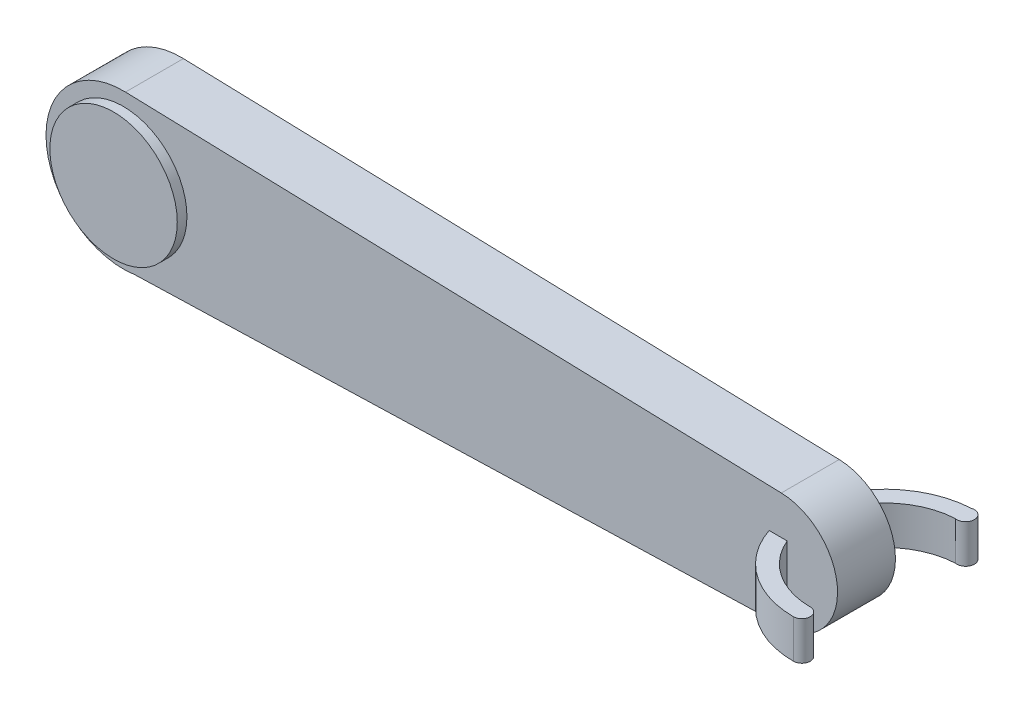
ISO-10303-21;
HEADER;
FILE_DESCRIPTION(('STEP AP214'),'2;1');
FILE_NAME('part.step','',(''),(''),'','','');
FILE_SCHEMA(('AUTOMOTIVE_DESIGN { 1 0 10303 214 1 1 1 1 }'));
ENDSEC;
DATA;
#1=APPLICATION_CONTEXT('core data for automotive mechanical design processes');
#2=APPLICATION_PROTOCOL_DEFINITION('international standard','automotive_design',2000,#1);
#3=PRODUCT_CONTEXT('',#1,'mechanical');
#4=PRODUCT('Part','Part','',(#3));
#5=PRODUCT_RELATED_PRODUCT_CATEGORY('part','',(#4));
#6=PRODUCT_DEFINITION_FORMATION('','',#4);
#7=PRODUCT_DEFINITION_CONTEXT('part definition',#1,'design');
#8=PRODUCT_DEFINITION('design','',#6,#7);
#9=PRODUCT_DEFINITION_SHAPE('','',#8);
#10=(LENGTH_UNIT() NAMED_UNIT(*) SI_UNIT(.MILLI.,.METRE.));
#11=(NAMED_UNIT(*) PLANE_ANGLE_UNIT() SI_UNIT($,.RADIAN.));
#12=(NAMED_UNIT(*) SI_UNIT($,.STERADIAN.) SOLID_ANGLE_UNIT());
#13=UNCERTAINTY_MEASURE_WITH_UNIT(LENGTH_MEASURE(1.E-05),#10,'distance_accuracy_value','');
#14=(GEOMETRIC_REPRESENTATION_CONTEXT(3) GLOBAL_UNCERTAINTY_ASSIGNED_CONTEXT((#13)) GLOBAL_UNIT_ASSIGNED_CONTEXT((#10,
#11,#12)) REPRESENTATION_CONTEXT('',''));
#15=CARTESIAN_POINT('',(0.,0.,0.));
#16=DIRECTION('',(0.,0.,1.));
#17=DIRECTION('',(1.,0.,0.));
#18=AXIS2_PLACEMENT_3D('',#15,#16,#17);
#19=CARTESIAN_POINT('',(0.,0.,7.5));
#20=DIRECTION('',(0.,0.,1.));
#21=DIRECTION('',(1.,0.,0.));
#22=AXIS2_PLACEMENT_3D('',#19,#20,#21);
#23=PLANE('',#22);
#24=CARTESIAN_POINT('',(-85.,0.,7.5));
#25=DIRECTION('',(0.,0.,1.));
#26=DIRECTION('',(1.,0.,0.));
#27=AXIS2_PLACEMENT_3D('',#24,#25,#26);
#28=CIRCLE('',#27,16.5);
#29=CARTESIAN_POINT('',(-68.5,0.,7.5));
#30=VERTEX_POINT('',#29);
#31=EDGE_CURVE('E222',#30,#30,#28,.F.);
#32=ORIENTED_EDGE('',*,*,#31,.T.);
#33=EDGE_LOOP('',(#32));
#34=FACE_BOUND('',#33,.T.);
#35=DIRECTION('',(0.999543215437971,0.0302218542105337,0.));
#36=VECTOR('',#35,1.);
#37=CARTESIAN_POINT('',(0.522370495305952,-17.2766330249204,7.5));
#38=LINE('',#37,#36);
#39=CARTESIAN_POINT('',(-81.9838543922029,-19.7712636336822,7.5));
#40=VERTEX_POINT('',#39);
#41=CARTESIAN_POINT('',(88.350129521236,-14.6211022905574,7.5));
#42=VERTEX_POINT('',#41);
#43=EDGE_CURVE('E223',#40,#42,#38,.T.);
#44=ORIENTED_EDGE('',*,*,#43,.T.);
#45=CARTESIAN_POINT('',(85.,0.,7.5));
#46=DIRECTION('',(0.,0.,1.));
#47=DIRECTION('',(1.,0.,0.));
#48=AXIS2_PLACEMENT_3D('',#45,#46,#47);
#49=CIRCLE('',#48,15.);
#50=CARTESIAN_POINT('',(85.4411764705882,14.9935107070292,7.5));
#51=VERTEX_POINT('',#50);
#52=EDGE_CURVE('E226',#42,#51,#49,.T.);
#53=ORIENTED_EDGE('',*,*,#52,.T.);
#54=DIRECTION('',(0.999567380468613,-0.0294117647058824,0.));
#55=VECTOR('',#54,1.);
#56=CARTESIAN_POINT('',(0.514705882352942,17.4924291582007,7.5));
#57=LINE('',#56,#55);
#58=CARTESIAN_POINT('',(-84.4117647058823,19.9913476093723,7.5));
#59=VERTEX_POINT('',#58);
#60=EDGE_CURVE('E229',#59,#51,#57,.T.);
#61=ORIENTED_EDGE('',*,*,#60,.F.);
#62=CARTESIAN_POINT('',(-85.,0.,7.5));
#63=DIRECTION('',(0.,0.,1.));
#64=DIRECTION('',(1.,0.,0.));
#65=AXIS2_PLACEMENT_3D('',#62,#63,#64);
#66=CIRCLE('',#65,20.);
#67=EDGE_CURVE('E232',#59,#40,#66,.T.);
#68=ORIENTED_EDGE('',*,*,#67,.T.);
#69=EDGE_LOOP('',(#44,#53,#61,#68));
#70=FACE_BOUND('',#69,.T.);
#71=DIRECTION('',(0.,-1.,0.));
#72=VECTOR('',#71,1.);
#73=CARTESIAN_POINT('',(86.9563657070354,5.,7.5));
#74=LINE('',#73,#72);
#75=CARTESIAN_POINT('',(86.9563657070354,5.,7.5));
#76=VERTEX_POINT('',#75);
#77=CARTESIAN_POINT('',(86.9563657070354,-5.,7.5));
#78=VERTEX_POINT('',#77);
#79=EDGE_CURVE('E93',#76,#78,#74,.T.);
#80=ORIENTED_EDGE('',*,*,#79,.T.);
#81=DIRECTION('',(-1.,0.,0.));
#82=VECTOR('',#81,1.);
#83=CARTESIAN_POINT('',(0.,-5.,7.5));
#84=LINE('',#83,#82);
#85=CARTESIAN_POINT('',(82.2870952426982,-5.,7.5));
#86=VERTEX_POINT('',#85);
#87=EDGE_CURVE('E88',#78,#86,#84,.T.);
#88=ORIENTED_EDGE('',*,*,#87,.T.);
#89=DIRECTION('',(0.,-1.,0.));
#90=VECTOR('',#89,1.);
#91=CARTESIAN_POINT('',(82.2870952426982,5.,7.5));
#92=LINE('',#91,#90);
#93=CARTESIAN_POINT('',(82.2870952426982,5.,7.5));
#94=VERTEX_POINT('',#93);
#95=EDGE_CURVE('E214',#86,#94,#92,.F.);
#96=ORIENTED_EDGE('',*,*,#95,.T.);
#97=DIRECTION('',(-1.,0.,0.));
#98=VECTOR('',#97,1.);
#99=CARTESIAN_POINT('',(0.,5.,7.5));
#100=LINE('',#99,#98);
#101=EDGE_CURVE('E170',#76,#94,#100,.T.);
#102=ORIENTED_EDGE('',*,*,#101,.F.);
#103=EDGE_LOOP('',(#80,#88,#96,#102));
#104=FACE_BOUND('',#103,.T.);
#105=ADVANCED_FACE('F73',(#34,#70,#104),#23,.T.);
#106=CARTESIAN_POINT('',(0.,0.,-7.5));
#107=DIRECTION('',(0.,0.,1.));
#108=DIRECTION('',(1.,0.,0.));
#109=AXIS2_PLACEMENT_3D('',#106,#107,#108);
#110=PLANE('',#109);
#111=DIRECTION('',(0.999543215437971,0.0302218542105337,0.));
#112=VECTOR('',#111,1.);
#113=CARTESIAN_POINT('',(0.522370495305952,-17.2766330249204,-7.5));
#114=LINE('',#113,#112);
#115=CARTESIAN_POINT('',(-81.9838543922029,-19.7712636336822,-7.5));
#116=VERTEX_POINT('',#115);
#117=CARTESIAN_POINT('',(88.350129521236,-14.6211022905574,-7.5));
#118=VERTEX_POINT('',#117);
#119=EDGE_CURVE('E235',#116,#118,#114,.T.);
#120=ORIENTED_EDGE('',*,*,#119,.F.);
#121=CARTESIAN_POINT('',(-85.,0.,-7.5));
#122=DIRECTION('',(0.,0.,1.));
#123=DIRECTION('',(1.,0.,0.));
#124=AXIS2_PLACEMENT_3D('',#121,#122,#123);
#125=CIRCLE('',#124,20.);
#126=CARTESIAN_POINT('',(-84.4117647058823,19.9913476093723,-7.5));
#127=VERTEX_POINT('',#126);
#128=EDGE_CURVE('E227',#127,#116,#125,.T.);
#129=ORIENTED_EDGE('',*,*,#128,.F.);
#130=DIRECTION('',(0.999567380468613,-0.0294117647058824,0.));
#131=VECTOR('',#130,1.);
#132=CARTESIAN_POINT('',(0.514705882352942,17.4924291582007,-7.5));
#133=LINE('',#132,#131);
#134=CARTESIAN_POINT('',(85.4411764705882,14.9935107070292,-7.5));
#135=VERTEX_POINT('',#134);
#136=EDGE_CURVE('E241',#127,#135,#133,.T.);
#137=ORIENTED_EDGE('',*,*,#136,.T.);
#138=CARTESIAN_POINT('',(85.,0.,-7.5));
#139=DIRECTION('',(0.,0.,1.));
#140=DIRECTION('',(1.,0.,0.));
#141=AXIS2_PLACEMENT_3D('',#138,#139,#140);
#142=CIRCLE('',#141,15.);
#143=EDGE_CURVE('E238',#118,#135,#142,.T.);
#144=ORIENTED_EDGE('',*,*,#143,.F.);
#145=EDGE_LOOP('',(#120,#129,#137,#144));
#146=FACE_BOUND('',#145,.T.);
#147=CARTESIAN_POINT('',(-85.,0.,-7.5));
#148=DIRECTION('',(0.,0.,1.));
#149=DIRECTION('',(1.,0.,0.));
#150=AXIS2_PLACEMENT_3D('',#147,#148,#149);
#151=CIRCLE('',#150,5.);
#152=CARTESIAN_POINT('',(-80.,0.,-7.5));
#153=VERTEX_POINT('',#152);
#154=EDGE_CURVE('E254',#153,#153,#151,.F.);
#155=ORIENTED_EDGE('',*,*,#154,.F.);
#156=EDGE_LOOP('',(#155));
#157=FACE_BOUND('',#156,.T.);
#158=DIRECTION('',(-1.,0.,0.));
#159=VECTOR('',#158,1.);
#160=CARTESIAN_POINT('',(0.,-5.,-7.5));
#161=LINE('',#160,#159);
#162=CARTESIAN_POINT('',(86.9563657070354,-5.,-7.5));
#163=VERTEX_POINT('',#162);
#164=CARTESIAN_POINT('',(82.2870952426982,-5.,-7.5));
#165=VERTEX_POINT('',#164);
#166=EDGE_CURVE('E12',#163,#165,#161,.T.);
#167=ORIENTED_EDGE('',*,*,#166,.F.);
#168=DIRECTION('',(0.,-1.,0.));
#169=VECTOR('',#168,1.);
#170=CARTESIAN_POINT('',(86.9563657070354,5.,-7.5));
#171=LINE('',#170,#169);
#172=CARTESIAN_POINT('',(86.9563657070354,5.,-7.5));
#173=VERTEX_POINT('',#172);
#174=EDGE_CURVE('E261',#173,#163,#171,.T.);
#175=ORIENTED_EDGE('',*,*,#174,.F.);
#176=DIRECTION('',(-1.,0.,0.));
#177=VECTOR('',#176,1.);
#178=CARTESIAN_POINT('',(0.,5.,-7.5));
#179=LINE('',#178,#177);
#180=CARTESIAN_POINT('',(82.2870952426982,5.,-7.5));
#181=VERTEX_POINT('',#180);
#182=EDGE_CURVE('E259',#173,#181,#179,.T.);
#183=ORIENTED_EDGE('',*,*,#182,.T.);
#184=DIRECTION('',(0.,-1.,0.));
#185=VECTOR('',#184,1.);
#186=CARTESIAN_POINT('',(82.2870952426982,5.,-7.5));
#187=LINE('',#186,#185);
#188=EDGE_CURVE('E81',#165,#181,#187,.F.);
#189=ORIENTED_EDGE('',*,*,#188,.F.);
#190=EDGE_LOOP('',(#167,#175,#183,#189));
#191=FACE_BOUND('',#190,.T.);
#192=ADVANCED_FACE('F270',(#146,#157,#191),#110,.F.);
#193=CARTESIAN_POINT('',(0.522370495305952,-17.2766330249204,7.5));
#194=DIRECTION('',(-0.0302218542105337,0.999543215437971,0.));
#195=DIRECTION('',(-0.999543215437971,-0.0302218542105337,0.));
#196=AXIS2_PLACEMENT_3D('',#193,#194,#195);
#197=PLANE('',#196);
#198=ORIENTED_EDGE('',*,*,#119,.T.);
#199=DIRECTION('',(0.,0.,-1.));
#200=VECTOR('',#199,1.);
#201=CARTESIAN_POINT('',(88.350129521236,-14.6211022905574,7.5));
#202=LINE('',#201,#200);
#203=EDGE_CURVE('E251',#42,#118,#202,.T.);
#204=ORIENTED_EDGE('',*,*,#203,.F.);
#205=ORIENTED_EDGE('',*,*,#43,.F.);
#206=DIRECTION('',(0.,0.,-1.));
#207=VECTOR('',#206,1.);
#208=CARTESIAN_POINT('',(-81.9838543922029,-19.7712636336822,7.5));
#209=LINE('',#208,#207);
#210=EDGE_CURVE('E234',#40,#116,#209,.T.);
#211=ORIENTED_EDGE('',*,*,#210,.T.);
#212=EDGE_LOOP('',(#198,#204,#205,#211));
#213=FACE_BOUND('',#212,.T.);
#214=ADVANCED_FACE('F75',(#213),#197,.F.);
#215=CARTESIAN_POINT('',(85.,0.,7.5));
#216=DIRECTION('',(0.,0.,-1.));
#217=DIRECTION('',(-1.,0.,0.));
#218=AXIS2_PLACEMENT_3D('',#215,#216,#217);
#219=CYLINDRICAL_SURFACE('',#218,15.);
#220=ORIENTED_EDGE('',*,*,#143,.T.);
#221=DIRECTION('',(0.,0.,-1.));
#222=VECTOR('',#221,1.);
#223=CARTESIAN_POINT('',(85.4411764705882,14.9935107070292,7.5));
#224=LINE('',#223,#222);
#225=EDGE_CURVE('E249',#51,#135,#224,.T.);
#226=ORIENTED_EDGE('',*,*,#225,.F.);
#227=ORIENTED_EDGE('',*,*,#52,.F.);
#228=ORIENTED_EDGE('',*,*,#203,.T.);
#229=EDGE_LOOP('',(#220,#226,#227,#228));
#230=FACE_BOUND('',#229,.T.);
#231=ADVANCED_FACE('F278',(#230),#219,.T.);
#232=CARTESIAN_POINT('',(0.514705882352942,17.4924291582007,7.5));
#233=DIRECTION('',(0.0294117647058824,0.999567380468613,0.));
#234=DIRECTION('',(-0.999567380468614,0.0294117647058824,0.));
#235=AXIS2_PLACEMENT_3D('',#232,#233,#234);
#236=PLANE('',#235);
#237=ORIENTED_EDGE('',*,*,#136,.F.);
#238=DIRECTION('',(0.,0.,-1.));
#239=VECTOR('',#238,1.);
#240=CARTESIAN_POINT('',(-84.4117647058823,19.9913476093723,7.5));
#241=LINE('',#240,#239);
#242=EDGE_CURVE('E247',#59,#127,#241,.T.);
#243=ORIENTED_EDGE('',*,*,#242,.F.);
#244=ORIENTED_EDGE('',*,*,#60,.T.);
#245=ORIENTED_EDGE('',*,*,#225,.T.);
#246=EDGE_LOOP('',(#237,#243,#244,#245));
#247=FACE_BOUND('',#246,.T.);
#248=ADVANCED_FACE('F290',(#247),#236,.T.);
#249=CARTESIAN_POINT('',(-85.,0.,7.5));
#250=DIRECTION('',(0.,0.,-1.));
#251=DIRECTION('',(-1.,0.,0.));
#252=AXIS2_PLACEMENT_3D('',#249,#250,#251);
#253=CYLINDRICAL_SURFACE('',#252,20.);
#254=ORIENTED_EDGE('',*,*,#128,.T.);
#255=ORIENTED_EDGE('',*,*,#210,.F.);
#256=ORIENTED_EDGE('',*,*,#67,.F.);
#257=ORIENTED_EDGE('',*,*,#242,.T.);
#258=EDGE_LOOP('',(#254,#255,#256,#257));
#259=FACE_BOUND('',#258,.T.);
#260=ADVANCED_FACE('F286',(#259),#253,.T.);
#261=CARTESIAN_POINT('',(-85.,0.,10.));
#262=DIRECTION('',(0.,0.,-1.));
#263=DIRECTION('',(-1.,0.,0.));
#264=AXIS2_PLACEMENT_3D('',#261,#262,#263);
#265=CYLINDRICAL_SURFACE('',#264,16.5);
#266=ORIENTED_EDGE('',*,*,#31,.F.);
#267=EDGE_LOOP('',(#266));
#268=FACE_BOUND('',#267,.T.);
#269=CARTESIAN_POINT('',(-85.,0.,10.));
#270=DIRECTION('',(0.,0.,1.));
#271=DIRECTION('',(1.,0.,0.));
#272=AXIS2_PLACEMENT_3D('',#269,#270,#271);
#273=CIRCLE('',#272,16.5);
#274=CARTESIAN_POINT('',(-68.5,0.,10.));
#275=VERTEX_POINT('',#274);
#276=EDGE_CURVE('E219',#275,#275,#273,.T.);
#277=ORIENTED_EDGE('',*,*,#276,.F.);
#278=EDGE_LOOP('',(#277));
#279=FACE_BOUND('',#278,.T.);
#280=ADVANCED_FACE('F289',(#268,#279),#265,.T.);
#281=CARTESIAN_POINT('',(-85.,0.,10.));
#282=DIRECTION('',(0.,0.,1.));
#283=DIRECTION('',(1.,0.,0.));
#284=AXIS2_PLACEMENT_3D('',#281,#282,#283);
#285=PLANE('',#284);
#286=ORIENTED_EDGE('',*,*,#276,.T.);
#287=EDGE_LOOP('',(#286));
#288=FACE_BOUND('',#287,.T.);
#289=ADVANCED_FACE('F323',(#288),#285,.T.);
#290=CARTESIAN_POINT('',(-85.,0.,-17.5));
#291=DIRECTION('',(0.,0.,1.));
#292=DIRECTION('',(1.,0.,0.));
#293=AXIS2_PLACEMENT_3D('',#290,#291,#292);
#294=CYLINDRICAL_SURFACE('',#293,5.);
#295=CARTESIAN_POINT('',(-85.,0.,-17.5));
#296=DIRECTION('',(0.,0.,-1.));
#297=DIRECTION('',(-1.,0.,0.));
#298=AXIS2_PLACEMENT_3D('',#295,#296,#297);
#299=CIRCLE('',#298,5.);
#300=CARTESIAN_POINT('',(-90.,0.,-17.5));
#301=VERTEX_POINT('',#300);
#302=EDGE_CURVE('E216',#301,#301,#299,.T.);
#303=ORIENTED_EDGE('',*,*,#302,.F.);
#304=EDGE_LOOP('',(#303));
#305=FACE_BOUND('',#304,.T.);
#306=ORIENTED_EDGE('',*,*,#154,.T.);
#307=EDGE_LOOP('',(#306));
#308=FACE_BOUND('',#307,.T.);
#309=ADVANCED_FACE('F330',(#305,#308),#294,.T.);
#310=CARTESIAN_POINT('',(-85.,0.,-17.5));
#311=DIRECTION('',(0.,0.,-1.));
#312=DIRECTION('',(-1.,0.,0.));
#313=AXIS2_PLACEMENT_3D('',#310,#311,#312);
#314=PLANE('',#313);
#315=ORIENTED_EDGE('',*,*,#302,.T.);
#316=EDGE_LOOP('',(#315));
#317=FACE_BOUND('',#316,.T.);
#318=ADVANCED_FACE('F338',(#317),#314,.T.);
#319=CARTESIAN_POINT('',(104.177056757347,5.,-21.505889527873));
#320=DIRECTION('',(0.,-1.,0.));
#321=DIRECTION('',(0.,0.,-1.));
#322=AXIS2_PLACEMENT_3D('',#319,#320,#321);
#323=CYLINDRICAL_SURFACE('',#322,2.26284918829078);
#324=CARTESIAN_POINT('',(104.177056757347,-5.,-21.505889527873));
#325=DIRECTION('',(0.,1.,0.));
#326=DIRECTION('',(0.,0.,1.));
#327=AXIS2_PLACEMENT_3D('',#324,#325,#326);
#328=CIRCLE('',#327,2.26284918829078);
#329=CARTESIAN_POINT('',(103.712763512702,-5.,-19.2911845290242));
#330=VERTEX_POINT('',#329);
#331=CARTESIAN_POINT('',(103.475564720802,-5.,-23.6572601076694));
#332=VERTEX_POINT('',#331);
#333=EDGE_CURVE('E165',#330,#332,#328,.T.);
#334=ORIENTED_EDGE('',*,*,#333,.T.);
#335=DIRECTION('',(0.,-1.,0.));
#336=VECTOR('',#335,1.);
#337=CARTESIAN_POINT('',(103.475564720802,5.,-23.6572601076694));
#338=LINE('',#337,#336);
#339=CARTESIAN_POINT('',(103.475564720802,5.,-23.6572601076694));
#340=VERTEX_POINT('',#339);
#341=EDGE_CURVE('E159',#340,#332,#338,.T.);
#342=ORIENTED_EDGE('',*,*,#341,.F.);
#343=CARTESIAN_POINT('',(104.177056757347,5.,-21.505889527873));
#344=DIRECTION('',(0.,1.,0.));
#345=DIRECTION('',(0.,0.,1.));
#346=AXIS2_PLACEMENT_3D('',#343,#344,#345);
#347=CIRCLE('',#346,2.26284918829078);
#348=CARTESIAN_POINT('',(103.712763512702,5.,-19.2911845290242));
#349=VERTEX_POINT('',#348);
#350=EDGE_CURVE('E163',#349,#340,#347,.T.);
#351=ORIENTED_EDGE('',*,*,#350,.F.);
#352=DIRECTION('',(0.,-1.,0.));
#353=VECTOR('',#352,1.);
#354=CARTESIAN_POINT('',(103.712763512702,5.,-19.2911845290242));
#355=LINE('',#354,#353);
#356=EDGE_CURVE('E192',#349,#330,#355,.T.);
#357=ORIENTED_EDGE('',*,*,#356,.T.);
#358=EDGE_LOOP('',(#334,#342,#351,#357));
#359=FACE_BOUND('',#358,.T.);
#360=ADVANCED_FACE('F161',(#359),#323,.T.);
#361=CARTESIAN_POINT('',(0.,-5.,0.));
#362=DIRECTION('',(0.,1.,0.));
#363=DIRECTION('',(0.,0.,1.));
#364=AXIS2_PLACEMENT_3D('',#361,#362,#363);
#365=PLANE('',#364);
#366=CARTESIAN_POINT('',(104.760808967294,-5.,0.));
#367=DIRECTION('',(0.,1.,0.));
#368=DIRECTION('',(0.,0.,1.));
#369=AXIS2_PLACEMENT_3D('',#366,#367,#368);
#370=CIRCLE('',#369,19.3196324967053);
#371=EDGE_CURVE('E195',#163,#330,#370,.F.);
#372=ORIENTED_EDGE('',*,*,#371,.F.);
#373=ORIENTED_EDGE('',*,*,#166,.T.);
#374=CARTESIAN_POINT('',(104.760808967294,-5.,0.));
#375=DIRECTION('',(0.,1.,0.));
#376=DIRECTION('',(0.,0.,1.));
#377=AXIS2_PLACEMENT_3D('',#374,#375,#376);
#378=CIRCLE('',#377,23.6921465590407);
#379=EDGE_CURVE('E193',#332,#165,#378,.T.);
#380=ORIENTED_EDGE('',*,*,#379,.F.);
#381=ORIENTED_EDGE('',*,*,#333,.F.);
#382=EDGE_LOOP('',(#372,#373,#380,#381));
#383=FACE_BOUND('',#382,.T.);
#384=ADVANCED_FACE('F269',(#383),#365,.F.);
#385=CARTESIAN_POINT('',(0.,5.,0.));
#386=DIRECTION('',(0.,1.,0.));
#387=DIRECTION('',(0.,0.,1.));
#388=AXIS2_PLACEMENT_3D('',#385,#386,#387);
#389=PLANE('',#388);
#390=ORIENTED_EDGE('',*,*,#182,.F.);
#391=CARTESIAN_POINT('',(104.760808967294,5.,0.));
#392=DIRECTION('',(0.,1.,0.));
#393=DIRECTION('',(0.,0.,1.));
#394=AXIS2_PLACEMENT_3D('',#391,#392,#393);
#395=CIRCLE('',#394,19.3196324967053);
#396=EDGE_CURVE('E178',#173,#349,#395,.F.);
#397=ORIENTED_EDGE('',*,*,#396,.T.);
#398=ORIENTED_EDGE('',*,*,#350,.T.);
#399=CARTESIAN_POINT('',(104.760808967294,5.,0.));
#400=DIRECTION('',(0.,1.,0.));
#401=DIRECTION('',(0.,0.,1.));
#402=AXIS2_PLACEMENT_3D('',#399,#400,#401);
#403=CIRCLE('',#402,23.6921465590407);
#404=EDGE_CURVE('E175',#340,#181,#403,.T.);
#405=ORIENTED_EDGE('',*,*,#404,.T.);
#406=EDGE_LOOP('',(#390,#397,#398,#405));
#407=FACE_BOUND('',#406,.T.);
#408=ADVANCED_FACE('F174',(#407),#389,.T.);
#409=CARTESIAN_POINT('',(104.760808967294,5.,0.));
#410=DIRECTION('',(0.,-1.,0.));
#411=DIRECTION('',(0.,0.,-1.));
#412=AXIS2_PLACEMENT_3D('',#409,#410,#411);
#413=CYLINDRICAL_SURFACE('',#412,19.3196324967053);
#414=ORIENTED_EDGE('',*,*,#396,.F.);
#415=ORIENTED_EDGE('',*,*,#174,.T.);
#416=ORIENTED_EDGE('',*,*,#371,.T.);
#417=ORIENTED_EDGE('',*,*,#356,.F.);
#418=EDGE_LOOP('',(#414,#415,#416,#417));
#419=FACE_BOUND('',#418,.T.);
#420=ADVANCED_FACE('F265',(#419),#413,.F.);
#421=CARTESIAN_POINT('',(104.760808967294,5.,0.));
#422=DIRECTION('',(0.,-1.,0.));
#423=DIRECTION('',(0.,0.,-1.));
#424=AXIS2_PLACEMENT_3D('',#421,#422,#423);
#425=CYLINDRICAL_SURFACE('',#424,23.6921465590407);
#426=ORIENTED_EDGE('',*,*,#379,.T.);
#427=ORIENTED_EDGE('',*,*,#188,.T.);
#428=ORIENTED_EDGE('',*,*,#404,.F.);
#429=ORIENTED_EDGE('',*,*,#341,.T.);
#430=EDGE_LOOP('',(#426,#427,#428,#429));
#431=FACE_BOUND('',#430,.T.);
#432=ADVANCED_FACE('F182',(#431),#425,.T.);
#433=ORIENTED_EDGE('',*,*,#95,.F.);
#434=CARTESIAN_POINT('',(104.760808967294,-5.,23.6921465590407));
#435=VERTEX_POINT('',#434);
#436=EDGE_CURVE('E196',#86,#435,#378,.T.);
#437=ORIENTED_EDGE('',*,*,#436,.T.);
#438=DIRECTION('',(0.,-1.,0.));
#439=VECTOR('',#438,1.);
#440=CARTESIAN_POINT('',(104.760808967294,5.,23.6921465590407));
#441=LINE('',#440,#439);
#442=CARTESIAN_POINT('',(104.760808967294,5.,23.6921465590407));
#443=VERTEX_POINT('',#442);
#444=EDGE_CURVE('E171',#443,#435,#441,.T.);
#445=ORIENTED_EDGE('',*,*,#444,.F.);
#446=EDGE_CURVE('E185',#94,#443,#403,.T.);
#447=ORIENTED_EDGE('',*,*,#446,.F.);
#448=EDGE_LOOP('',(#433,#437,#445,#447));
#449=FACE_BOUND('',#448,.T.);
#450=ADVANCED_FACE('F381',(#449),#425,.T.);
#451=ORIENTED_EDGE('',*,*,#79,.F.);
#452=CARTESIAN_POINT('',(104.760808967294,5.,19.3196324967053));
#453=VERTEX_POINT('',#452);
#454=EDGE_CURVE('E187',#453,#76,#395,.F.);
#455=ORIENTED_EDGE('',*,*,#454,.F.);
#456=DIRECTION('',(0.,-1.,0.));
#457=VECTOR('',#456,1.);
#458=CARTESIAN_POINT('',(104.760808967294,5.,19.3196324967053));
#459=LINE('',#458,#457);
#460=CARTESIAN_POINT('',(104.760808967294,-5.,19.3196324967053));
#461=VERTEX_POINT('',#460);
#462=EDGE_CURVE('E200',#453,#461,#459,.T.);
#463=ORIENTED_EDGE('',*,*,#462,.T.);
#464=EDGE_CURVE('E189',#461,#78,#370,.F.);
#465=ORIENTED_EDGE('',*,*,#464,.T.);
#466=EDGE_LOOP('',(#451,#455,#463,#465));
#467=FACE_BOUND('',#466,.T.);
#468=ADVANCED_FACE('F375',(#467),#413,.F.);
#469=ORIENTED_EDGE('',*,*,#87,.F.);
#470=ORIENTED_EDGE('',*,*,#464,.F.);
#471=CARTESIAN_POINT('',(104.760808967294,-5.,21.505889527873));
#472=DIRECTION('',(0.,1.,0.));
#473=DIRECTION('',(0.,0.,1.));
#474=AXIS2_PLACEMENT_3D('',#471,#472,#473);
#475=CIRCLE('',#474,2.1862570311677);
#476=EDGE_CURVE('E180',#435,#461,#475,.T.);
#477=ORIENTED_EDGE('',*,*,#476,.F.);
#478=ORIENTED_EDGE('',*,*,#436,.F.);
#479=EDGE_LOOP('',(#469,#470,#477,#478));
#480=FACE_BOUND('',#479,.T.);
#481=ADVANCED_FACE('F361',(#480),#365,.F.);
#482=ORIENTED_EDGE('',*,*,#454,.T.);
#483=ORIENTED_EDGE('',*,*,#101,.T.);
#484=ORIENTED_EDGE('',*,*,#446,.T.);
#485=CARTESIAN_POINT('',(104.760808967294,5.,21.505889527873));
#486=DIRECTION('',(0.,1.,0.));
#487=DIRECTION('',(0.,0.,1.));
#488=AXIS2_PLACEMENT_3D('',#485,#486,#487);
#489=CIRCLE('',#488,2.1862570311677);
#490=EDGE_CURVE('E204',#443,#453,#489,.T.);
#491=ORIENTED_EDGE('',*,*,#490,.T.);
#492=EDGE_LOOP('',(#482,#483,#484,#491));
#493=FACE_BOUND('',#492,.T.);
#494=ADVANCED_FACE('F368',(#493),#389,.T.);
#495=CARTESIAN_POINT('',(104.760808967294,5.,21.505889527873));
#496=DIRECTION('',(0.,-1.,0.));
#497=DIRECTION('',(0.,0.,-1.));
#498=AXIS2_PLACEMENT_3D('',#495,#496,#497);
#499=CYLINDRICAL_SURFACE('',#498,2.1862570311677);
#500=ORIENTED_EDGE('',*,*,#490,.F.);
#501=ORIENTED_EDGE('',*,*,#444,.T.);
#502=ORIENTED_EDGE('',*,*,#476,.T.);
#503=ORIENTED_EDGE('',*,*,#462,.F.);
#504=EDGE_LOOP('',(#500,#501,#502,#503));
#505=FACE_BOUND('',#504,.T.);
#506=ADVANCED_FACE('F406',(#505),#499,.T.);
#507=CLOSED_SHELL('',(#105,#192,#214,#231,#248,#260,#280,#289,#309,#318,#360,#384,#408,#420,
#432,#450,#468,#481,#494,#506));
#508=MANIFOLD_SOLID_BREP('B2',#507);
#509=ADVANCED_BREP_SHAPE_REPRESENTATION('',(#18,#508),#14);
#510=SHAPE_DEFINITION_REPRESENTATION(#9,#509);
ENDSEC;
END-ISO-10303-21;
